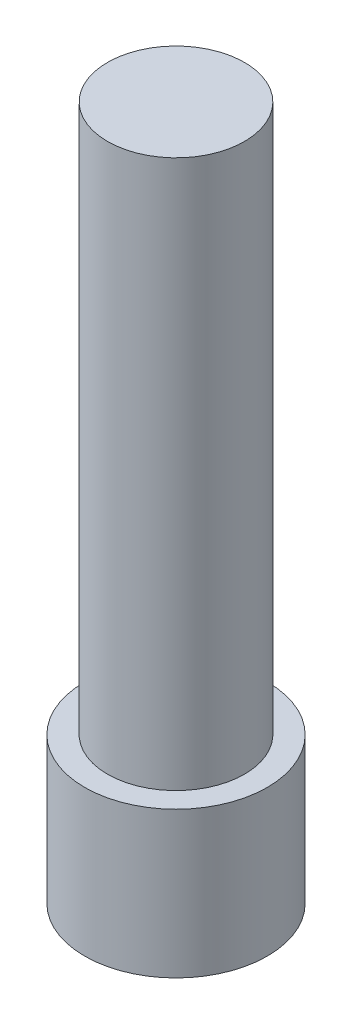
ISO-10303-21;
HEADER;
FILE_DESCRIPTION(('STEP AP214'),'2;1');
FILE_NAME('part.step','',(''),(''),'','','');
FILE_SCHEMA(('AUTOMOTIVE_DESIGN { 1 0 10303 214 1 1 1 1 }'));
ENDSEC;
DATA;
#1=APPLICATION_CONTEXT('core data for automotive mechanical design processes');
#2=APPLICATION_PROTOCOL_DEFINITION('international standard','automotive_design',2000,#1);
#3=PRODUCT_CONTEXT('',#1,'mechanical');
#4=PRODUCT('Part','Part','',(#3));
#5=PRODUCT_RELATED_PRODUCT_CATEGORY('part','',(#4));
#6=PRODUCT_DEFINITION_FORMATION('','',#4);
#7=PRODUCT_DEFINITION_CONTEXT('part definition',#1,'design');
#8=PRODUCT_DEFINITION('design','',#6,#7);
#9=PRODUCT_DEFINITION_SHAPE('','',#8);
#10=(LENGTH_UNIT() NAMED_UNIT(*) SI_UNIT(.MILLI.,.METRE.));
#11=(NAMED_UNIT(*) PLANE_ANGLE_UNIT() SI_UNIT($,.RADIAN.));
#12=(NAMED_UNIT(*) SI_UNIT($,.STERADIAN.) SOLID_ANGLE_UNIT());
#13=UNCERTAINTY_MEASURE_WITH_UNIT(LENGTH_MEASURE(1.E-05),#10,'distance_accuracy_value','');
#14=(GEOMETRIC_REPRESENTATION_CONTEXT(3) GLOBAL_UNCERTAINTY_ASSIGNED_CONTEXT((#13)) GLOBAL_UNIT_ASSIGNED_CONTEXT((#10,
#11,#12)) REPRESENTATION_CONTEXT('',''));
#15=CARTESIAN_POINT('',(0.,0.,0.));
#16=DIRECTION('',(0.,0.,1.));
#17=DIRECTION('',(1.,0.,0.));
#18=AXIS2_PLACEMENT_3D('',#15,#16,#17);
#19=CARTESIAN_POINT('',(0.,300.,0.));
#20=DIRECTION('',(0.,-1.,0.));
#21=DIRECTION('',(0.,0.,-1.));
#22=AXIS2_PLACEMENT_3D('',#19,#20,#21);
#23=CYLINDRICAL_SURFACE('',#22,37.5);
#24=CARTESIAN_POINT('',(0.,300.,0.));
#25=DIRECTION('',(0.,1.,0.));
#26=DIRECTION('',(0.,0.,1.));
#27=AXIS2_PLACEMENT_3D('',#24,#25,#26);
#28=CIRCLE('',#27,37.5);
#29=CARTESIAN_POINT('',(0.,300.,37.5));
#30=VERTEX_POINT('',#29);
#31=EDGE_CURVE('E10',#30,#30,#28,.T.);
#32=ORIENTED_EDGE('',*,*,#31,.F.);
#33=EDGE_LOOP('',(#32));
#34=FACE_BOUND('',#33,.T.);
#35=CARTESIAN_POINT('',(0.,0.,0.));
#36=DIRECTION('',(0.,1.,0.));
#37=DIRECTION('',(0.,0.,1.));
#38=AXIS2_PLACEMENT_3D('',#35,#36,#37);
#39=CIRCLE('',#38,37.5);
#40=CARTESIAN_POINT('',(0.,0.,37.5));
#41=VERTEX_POINT('',#40);
#42=EDGE_CURVE('E34',#41,#41,#39,.T.);
#43=ORIENTED_EDGE('',*,*,#42,.T.);
#44=EDGE_LOOP('',(#43));
#45=FACE_BOUND('',#44,.T.);
#46=ADVANCED_FACE('F31',(#34,#45),#23,.T.);
#47=CARTESIAN_POINT('',(0.,300.,0.));
#48=DIRECTION('',(0.,1.,0.));
#49=DIRECTION('',(0.,0.,1.));
#50=AXIS2_PLACEMENT_3D('',#47,#48,#49);
#51=PLANE('',#50);
#52=ORIENTED_EDGE('',*,*,#31,.T.);
#53=EDGE_LOOP('',(#52));
#54=FACE_BOUND('',#53,.T.);
#55=ADVANCED_FACE('F62',(#54),#51,.T.);
#56=CARTESIAN_POINT('',(0.,-80.,0.));
#57=DIRECTION('',(0.,1.,0.));
#58=DIRECTION('',(0.,0.,1.));
#59=AXIS2_PLACEMENT_3D('',#56,#57,#58);
#60=CYLINDRICAL_SURFACE('',#59,50.);
#61=CARTESIAN_POINT('',(0.,-80.,0.));
#62=DIRECTION('',(0.,1.,0.));
#63=DIRECTION('',(0.,0.,1.));
#64=AXIS2_PLACEMENT_3D('',#61,#62,#63);
#65=CIRCLE('',#64,50.);
#66=CARTESIAN_POINT('',(0.,-80.,50.));
#67=VERTEX_POINT('',#66);
#68=EDGE_CURVE('E41',#67,#67,#65,.T.);
#69=ORIENTED_EDGE('',*,*,#68,.T.);
#70=EDGE_LOOP('',(#69));
#71=FACE_BOUND('',#70,.T.);
#72=CARTESIAN_POINT('',(0.,0.,0.));
#73=DIRECTION('',(0.,1.,0.));
#74=DIRECTION('',(0.,0.,1.));
#75=AXIS2_PLACEMENT_3D('',#72,#73,#74);
#76=CIRCLE('',#75,50.);
#77=CARTESIAN_POINT('',(0.,0.,50.));
#78=VERTEX_POINT('',#77);
#79=EDGE_CURVE('E43',#78,#78,#76,.T.);
#80=ORIENTED_EDGE('',*,*,#79,.F.);
#81=EDGE_LOOP('',(#80));
#82=FACE_BOUND('',#81,.T.);
#83=ADVANCED_FACE('F49',(#71,#82),#60,.T.);
#84=CARTESIAN_POINT('',(0.,-80.,0.));
#85=DIRECTION('',(0.,1.,0.));
#86=DIRECTION('',(0.,0.,1.));
#87=AXIS2_PLACEMENT_3D('',#84,#85,#86);
#88=PLANE('',#87);
#89=ORIENTED_EDGE('',*,*,#68,.F.);
#90=EDGE_LOOP('',(#89));
#91=FACE_BOUND('',#90,.T.);
#92=ADVANCED_FACE('F52',(#91),#88,.F.);
#93=CARTESIAN_POINT('',(0.,0.,0.));
#94=DIRECTION('',(0.,1.,0.));
#95=DIRECTION('',(0.,0.,1.));
#96=AXIS2_PLACEMENT_3D('',#93,#94,#95);
#97=PLANE('',#96);
#98=ORIENTED_EDGE('',*,*,#42,.F.);
#99=EDGE_LOOP('',(#98));
#100=FACE_BOUND('',#99,.T.);
#101=ORIENTED_EDGE('',*,*,#79,.T.);
#102=EDGE_LOOP('',(#101));
#103=FACE_BOUND('',#102,.T.);
#104=ADVANCED_FACE('F54',(#100,#103),#97,.T.);
#105=CLOSED_SHELL('',(#46,#55,#83,#92,#104));
#106=MANIFOLD_SOLID_BREP('B2',#105);
#107=ADVANCED_BREP_SHAPE_REPRESENTATION('',(#18,#106),#14);
#108=SHAPE_DEFINITION_REPRESENTATION(#9,#107);
ENDSEC;
END-ISO-10303-21;
